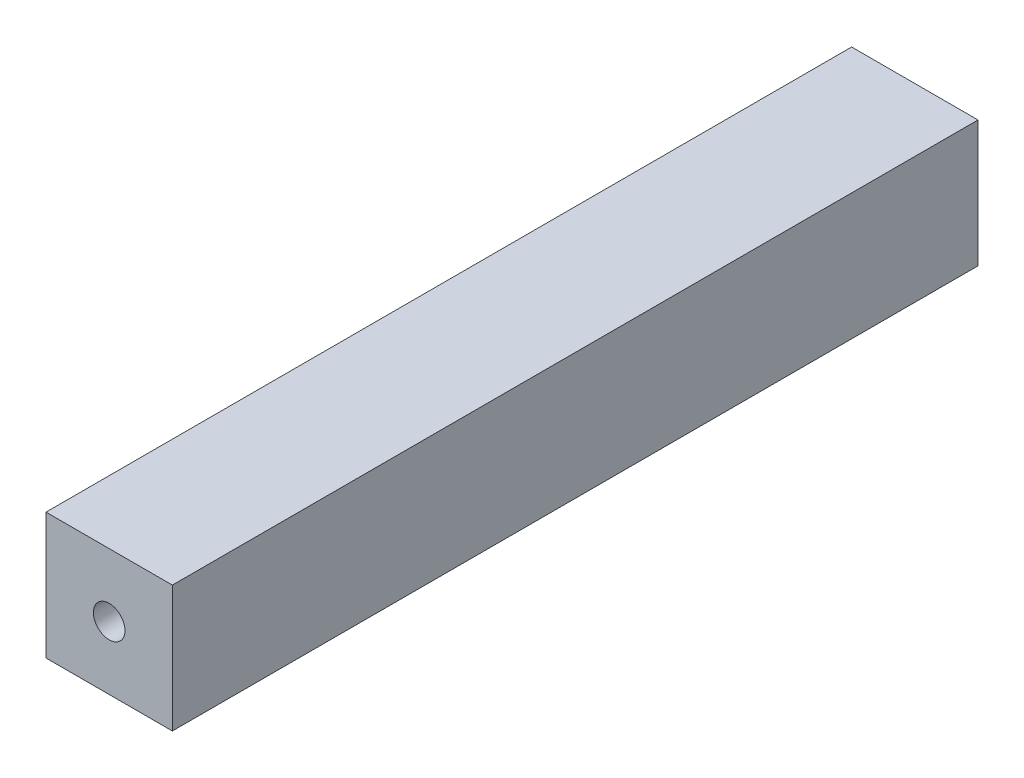
ISO-10303-21;
HEADER;
FILE_DESCRIPTION(('STEP AP214'),'2;1');
FILE_NAME('part.step','',(''),(''),'','','');
FILE_SCHEMA(('AUTOMOTIVE_DESIGN { 1 0 10303 214 1 1 1 1 }'));
ENDSEC;
DATA;
#1=APPLICATION_CONTEXT('core data for automotive mechanical design processes');
#2=APPLICATION_PROTOCOL_DEFINITION('international standard','automotive_design',2000,#1);
#3=PRODUCT_CONTEXT('',#1,'mechanical');
#4=PRODUCT('Part','Part','',(#3));
#5=PRODUCT_RELATED_PRODUCT_CATEGORY('part','',(#4));
#6=PRODUCT_DEFINITION_FORMATION('','',#4);
#7=PRODUCT_DEFINITION_CONTEXT('part definition',#1,'design');
#8=PRODUCT_DEFINITION('design','',#6,#7);
#9=PRODUCT_DEFINITION_SHAPE('','',#8);
#10=(LENGTH_UNIT() NAMED_UNIT(*) SI_UNIT(.MILLI.,.METRE.));
#11=(NAMED_UNIT(*) PLANE_ANGLE_UNIT() SI_UNIT($,.RADIAN.));
#12=(NAMED_UNIT(*) SI_UNIT($,.STERADIAN.) SOLID_ANGLE_UNIT());
#13=UNCERTAINTY_MEASURE_WITH_UNIT(LENGTH_MEASURE(1.E-05),#10,'distance_accuracy_value','');
#14=(GEOMETRIC_REPRESENTATION_CONTEXT(3) GLOBAL_UNCERTAINTY_ASSIGNED_CONTEXT((#13)) GLOBAL_UNIT_ASSIGNED_CONTEXT((#10,
#11,#12)) REPRESENTATION_CONTEXT('',''));
#15=CARTESIAN_POINT('',(0.,0.,0.));
#16=DIRECTION('',(0.,0.,1.));
#17=DIRECTION('',(1.,0.,0.));
#18=AXIS2_PLACEMENT_3D('',#15,#16,#17);
#19=CARTESIAN_POINT('',(556.,-189.,-255.));
#20=DIRECTION('',(0.,1.,0.));
#21=DIRECTION('',(0.,0.,1.));
#22=AXIS2_PLACEMENT_3D('',#19,#20,#21);
#23=PLANE('',#22);
#24=DIRECTION('',(-1.,0.,0.));
#25=VECTOR('',#24,1.);
#26=CARTESIAN_POINT('',(556.,-189.,0.));
#27=LINE('',#26,#25);
#28=CARTESIAN_POINT('',(556.,-189.,0.));
#29=VERTEX_POINT('',#28);
#30=CARTESIAN_POINT('',(516.,-189.,0.));
#31=VERTEX_POINT('',#30);
#32=EDGE_CURVE('E98',#29,#31,#27,.T.);
#33=ORIENTED_EDGE('',*,*,#32,.F.);
#34=DIRECTION('',(0.,0.,1.));
#35=VECTOR('',#34,1.);
#36=CARTESIAN_POINT('',(556.,-189.,-255.));
#37=LINE('',#36,#35);
#38=CARTESIAN_POINT('',(556.,-189.,-255.));
#39=VERTEX_POINT('',#38);
#40=EDGE_CURVE('E11',#39,#29,#37,.T.);
#41=ORIENTED_EDGE('',*,*,#40,.F.);
#42=DIRECTION('',(-1.,0.,0.));
#43=VECTOR('',#42,1.);
#44=CARTESIAN_POINT('',(556.,-189.,-255.));
#45=LINE('',#44,#43);
#46=CARTESIAN_POINT('',(516.,-189.,-255.));
#47=VERTEX_POINT('',#46);
#48=EDGE_CURVE('E91',#39,#47,#45,.T.);
#49=ORIENTED_EDGE('',*,*,#48,.T.);
#50=DIRECTION('',(0.,0.,1.));
#51=VECTOR('',#50,1.);
#52=CARTESIAN_POINT('',(516.,-189.,-255.));
#53=LINE('',#52,#51);
#54=EDGE_CURVE('E36',#47,#31,#53,.T.);
#55=ORIENTED_EDGE('',*,*,#54,.T.);
#56=EDGE_LOOP('',(#33,#41,#49,#55));
#57=FACE_BOUND('',#56,.T.);
#58=ADVANCED_FACE('F33',(#57),#23,.T.);
#59=CARTESIAN_POINT('',(556.,-229.,-255.));
#60=DIRECTION('',(1.,0.,0.));
#61=DIRECTION('',(0.,0.,-1.));
#62=AXIS2_PLACEMENT_3D('',#59,#60,#61);
#63=PLANE('',#62);
#64=DIRECTION('',(0.,1.,0.));
#65=VECTOR('',#64,1.);
#66=CARTESIAN_POINT('',(556.,-229.,0.));
#67=LINE('',#66,#65);
#68=CARTESIAN_POINT('',(556.,-229.,0.));
#69=VERTEX_POINT('',#68);
#70=EDGE_CURVE('E93',#69,#29,#67,.T.);
#71=ORIENTED_EDGE('',*,*,#70,.F.);
#72=DIRECTION('',(0.,0.,1.));
#73=VECTOR('',#72,1.);
#74=CARTESIAN_POINT('',(556.,-229.,-255.));
#75=LINE('',#74,#73);
#76=CARTESIAN_POINT('',(556.,-229.,-255.));
#77=VERTEX_POINT('',#76);
#78=EDGE_CURVE('E42',#77,#69,#75,.T.);
#79=ORIENTED_EDGE('',*,*,#78,.F.);
#80=DIRECTION('',(0.,1.,0.));
#81=VECTOR('',#80,1.);
#82=CARTESIAN_POINT('',(556.,-229.,-255.));
#83=LINE('',#82,#81);
#84=EDGE_CURVE('E88',#77,#39,#83,.T.);
#85=ORIENTED_EDGE('',*,*,#84,.T.);
#86=ORIENTED_EDGE('',*,*,#40,.T.);
#87=EDGE_LOOP('',(#71,#79,#85,#86));
#88=FACE_BOUND('',#87,.T.);
#89=ADVANCED_FACE('F109',(#88),#63,.T.);
#90=CARTESIAN_POINT('',(516.,-229.,-255.));
#91=DIRECTION('',(0.,-1.,0.));
#92=DIRECTION('',(0.,0.,-1.));
#93=AXIS2_PLACEMENT_3D('',#90,#91,#92);
#94=PLANE('',#93);
#95=DIRECTION('',(1.,0.,0.));
#96=VECTOR('',#95,1.);
#97=CARTESIAN_POINT('',(516.,-229.,0.));
#98=LINE('',#97,#96);
#99=CARTESIAN_POINT('',(516.,-229.,0.));
#100=VERTEX_POINT('',#99);
#101=EDGE_CURVE('E83',#100,#69,#98,.T.);
#102=ORIENTED_EDGE('',*,*,#101,.F.);
#103=DIRECTION('',(0.,0.,1.));
#104=VECTOR('',#103,1.);
#105=CARTESIAN_POINT('',(516.,-229.,-255.));
#106=LINE('',#105,#104);
#107=CARTESIAN_POINT('',(516.,-229.,-255.));
#108=VERTEX_POINT('',#107);
#109=EDGE_CURVE('E78',#108,#100,#106,.T.);
#110=ORIENTED_EDGE('',*,*,#109,.F.);
#111=DIRECTION('',(1.,0.,0.));
#112=VECTOR('',#111,1.);
#113=CARTESIAN_POINT('',(516.,-229.,-255.));
#114=LINE('',#113,#112);
#115=EDGE_CURVE('E81',#108,#77,#114,.T.);
#116=ORIENTED_EDGE('',*,*,#115,.T.);
#117=ORIENTED_EDGE('',*,*,#78,.T.);
#118=EDGE_LOOP('',(#102,#110,#116,#117));
#119=FACE_BOUND('',#118,.T.);
#120=ADVANCED_FACE('F80',(#119),#94,.T.);
#121=CARTESIAN_POINT('',(516.,-189.,-255.));
#122=DIRECTION('',(-1.,0.,0.));
#123=DIRECTION('',(0.,0.,1.));
#124=AXIS2_PLACEMENT_3D('',#121,#122,#123);
#125=PLANE('',#124);
#126=DIRECTION('',(0.,-1.,0.));
#127=VECTOR('',#126,1.);
#128=CARTESIAN_POINT('',(516.,-189.,0.));
#129=LINE('',#128,#127);
#130=EDGE_CURVE('E101',#31,#100,#129,.T.);
#131=ORIENTED_EDGE('',*,*,#130,.F.);
#132=ORIENTED_EDGE('',*,*,#54,.F.);
#133=DIRECTION('',(0.,-1.,0.));
#134=VECTOR('',#133,1.);
#135=CARTESIAN_POINT('',(516.,-189.,-255.));
#136=LINE('',#135,#134);
#137=EDGE_CURVE('E87',#47,#108,#136,.T.);
#138=ORIENTED_EDGE('',*,*,#137,.T.);
#139=ORIENTED_EDGE('',*,*,#109,.T.);
#140=EDGE_LOOP('',(#131,#132,#138,#139));
#141=FACE_BOUND('',#140,.T.);
#142=ADVANCED_FACE('F90',(#141),#125,.T.);
#143=CARTESIAN_POINT('',(0.,0.,-255.));
#144=DIRECTION('',(0.,0.,1.));
#145=DIRECTION('',(1.,0.,0.));
#146=AXIS2_PLACEMENT_3D('',#143,#144,#145);
#147=PLANE('',#146);
#148=CARTESIAN_POINT('',(536.,-209.,-255.));
#149=DIRECTION('',(0.,0.,1.));
#150=DIRECTION('',(1.,0.,0.));
#151=AXIS2_PLACEMENT_3D('',#148,#149,#150);
#152=CIRCLE('',#151,5.00000000000005);
#153=CARTESIAN_POINT('',(541.,-209.,-255.));
#154=VERTEX_POINT('',#153);
#155=EDGE_CURVE('E102',#154,#154,#152,.T.);
#156=ORIENTED_EDGE('',*,*,#155,.T.);
#157=EDGE_LOOP('',(#156));
#158=FACE_BOUND('',#157,.T.);
#159=ORIENTED_EDGE('',*,*,#48,.F.);
#160=ORIENTED_EDGE('',*,*,#84,.F.);
#161=ORIENTED_EDGE('',*,*,#115,.F.);
#162=ORIENTED_EDGE('',*,*,#137,.F.);
#163=EDGE_LOOP('',(#159,#160,#161,#162));
#164=FACE_BOUND('',#163,.T.);
#165=ADVANCED_FACE('F86',(#158,#164),#147,.F.);
#166=CARTESIAN_POINT('',(0.,0.,0.));
#167=DIRECTION('',(0.,0.,1.));
#168=DIRECTION('',(1.,0.,0.));
#169=AXIS2_PLACEMENT_3D('',#166,#167,#168);
#170=PLANE('',#169);
#171=CARTESIAN_POINT('',(536.,-209.,0.));
#172=DIRECTION('',(0.,0.,1.));
#173=DIRECTION('',(1.,0.,0.));
#174=AXIS2_PLACEMENT_3D('',#171,#172,#173);
#175=CIRCLE('',#174,5.00000000000005);
#176=CARTESIAN_POINT('',(541.,-209.,0.));
#177=VERTEX_POINT('',#176);
#178=EDGE_CURVE('E139',#177,#177,#175,.T.);
#179=ORIENTED_EDGE('',*,*,#178,.F.);
#180=EDGE_LOOP('',(#179));
#181=FACE_BOUND('',#180,.T.);
#182=ORIENTED_EDGE('',*,*,#32,.T.);
#183=ORIENTED_EDGE('',*,*,#130,.T.);
#184=ORIENTED_EDGE('',*,*,#101,.T.);
#185=ORIENTED_EDGE('',*,*,#70,.T.);
#186=EDGE_LOOP('',(#182,#183,#184,#185));
#187=FACE_BOUND('',#186,.T.);
#188=ADVANCED_FACE('F108',(#181,#187),#170,.T.);
#189=CARTESIAN_POINT('',(536.,-209.,-255.));
#190=DIRECTION('',(0.,0.,1.));
#191=DIRECTION('',(1.,0.,0.));
#192=AXIS2_PLACEMENT_3D('',#189,#190,#191);
#193=CYLINDRICAL_SURFACE('',#192,5.00000000000005);
#194=ORIENTED_EDGE('',*,*,#155,.F.);
#195=EDGE_LOOP('',(#194));
#196=FACE_BOUND('',#195,.T.);
#197=ORIENTED_EDGE('',*,*,#178,.T.);
#198=EDGE_LOOP('',(#197));
#199=FACE_BOUND('',#198,.T.);
#200=ADVANCED_FACE('F127',(#196,#199),#193,.F.);
#201=CLOSED_SHELL('',(#58,#89,#120,#142,#165,#188,#200));
#202=MANIFOLD_SOLID_BREP('B2',#201);
#203=ADVANCED_BREP_SHAPE_REPRESENTATION('',(#18,#202),#14);
#204=SHAPE_DEFINITION_REPRESENTATION(#9,#203);
ENDSEC;
END-ISO-10303-21;
